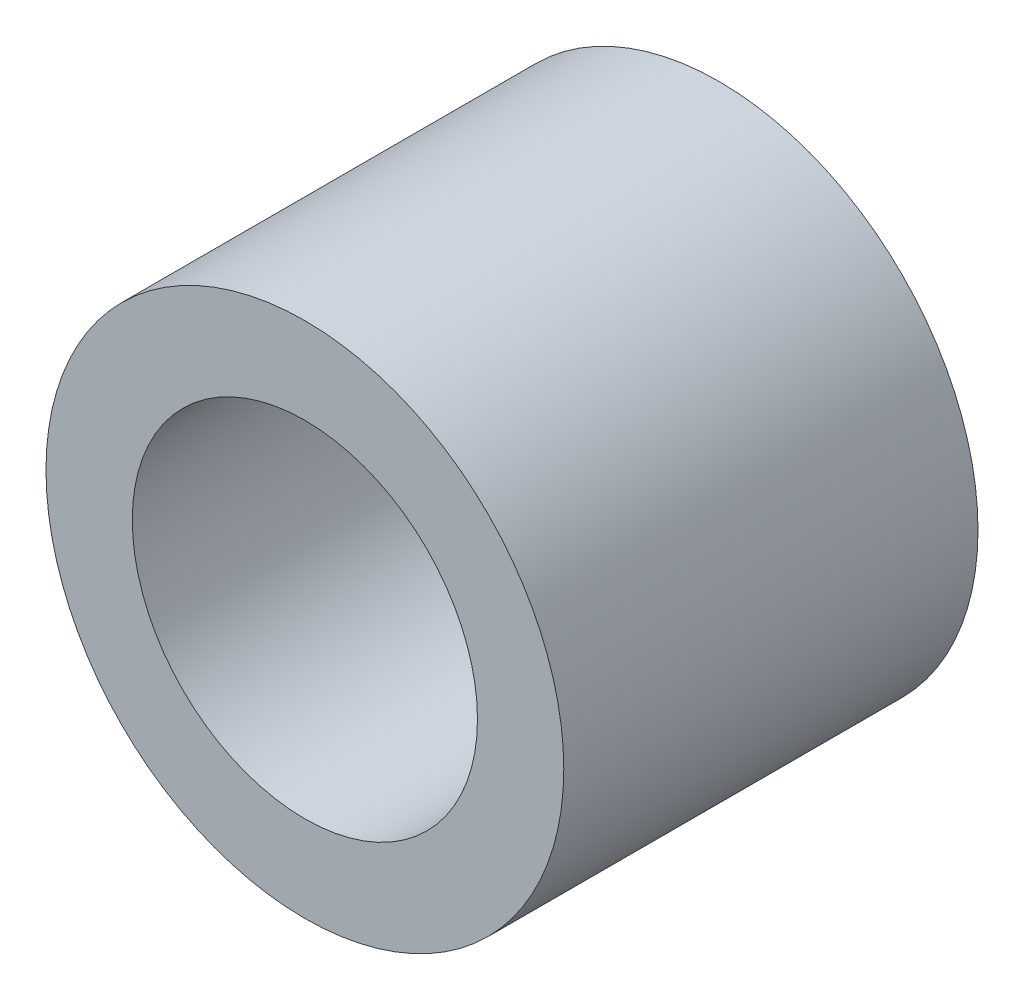
ISO-10303-21;
HEADER;
FILE_DESCRIPTION(('STEP AP214'),'2;1');
FILE_NAME('part.step','',(''),(''),'','','');
FILE_SCHEMA(('AUTOMOTIVE_DESIGN { 1 0 10303 214 1 1 1 1 }'));
ENDSEC;
DATA;
#1=APPLICATION_CONTEXT('core data for automotive mechanical design processes');
#2=APPLICATION_PROTOCOL_DEFINITION('international standard','automotive_design',2000,#1);
#3=PRODUCT_CONTEXT('',#1,'mechanical');
#4=PRODUCT('Part','Part','',(#3));
#5=PRODUCT_RELATED_PRODUCT_CATEGORY('part','',(#4));
#6=PRODUCT_DEFINITION_FORMATION('','',#4);
#7=PRODUCT_DEFINITION_CONTEXT('part definition',#1,'design');
#8=PRODUCT_DEFINITION('design','',#6,#7);
#9=PRODUCT_DEFINITION_SHAPE('','',#8);
#10=(LENGTH_UNIT() NAMED_UNIT(*) SI_UNIT(.MILLI.,.METRE.));
#11=(NAMED_UNIT(*) PLANE_ANGLE_UNIT() SI_UNIT($,.RADIAN.));
#12=(NAMED_UNIT(*) SI_UNIT($,.STERADIAN.) SOLID_ANGLE_UNIT());
#13=UNCERTAINTY_MEASURE_WITH_UNIT(LENGTH_MEASURE(1.E-05),#10,'distance_accuracy_value','');
#14=(GEOMETRIC_REPRESENTATION_CONTEXT(3) GLOBAL_UNCERTAINTY_ASSIGNED_CONTEXT((#13)) GLOBAL_UNIT_ASSIGNED_CONTEXT((#10,
#11,#12)) REPRESENTATION_CONTEXT('',''));
#15=CARTESIAN_POINT('',(0.,0.,0.));
#16=DIRECTION('',(0.,0.,1.));
#17=DIRECTION('',(1.,0.,0.));
#18=AXIS2_PLACEMENT_3D('',#15,#16,#17);
#19=CARTESIAN_POINT('',(0.,0.,15.24));
#20=DIRECTION('',(0.,0.,1.));
#21=DIRECTION('',(1.,0.,0.));
#22=AXIS2_PLACEMENT_3D('',#19,#20,#21);
#23=PLANE('',#22);
#24=CARTESIAN_POINT('',(0.,0.,15.24));
#25=DIRECTION('',(0.,0.,1.));
#26=DIRECTION('',(1.,0.,0.));
#27=AXIS2_PLACEMENT_3D('',#24,#25,#26);
#28=CIRCLE('',#27,9.525);
#29=CARTESIAN_POINT('',(9.525,0.,15.24));
#30=VERTEX_POINT('',#29);
#31=EDGE_CURVE('E10',#30,#30,#28,.T.);
#32=ORIENTED_EDGE('',*,*,#31,.T.);
#33=EDGE_LOOP('',(#32));
#34=FACE_BOUND('',#33,.T.);
#35=CARTESIAN_POINT('',(0.,0.,15.24));
#36=DIRECTION('',(0.,0.,1.));
#37=DIRECTION('',(1.,0.,0.));
#38=AXIS2_PLACEMENT_3D('',#35,#36,#37);
#39=CIRCLE('',#38,6.35);
#40=CARTESIAN_POINT('',(6.35,0.,15.24));
#41=VERTEX_POINT('',#40);
#42=EDGE_CURVE('E50',#41,#41,#39,.T.);
#43=ORIENTED_EDGE('',*,*,#42,.F.);
#44=EDGE_LOOP('',(#43));
#45=FACE_BOUND('',#44,.T.);
#46=ADVANCED_FACE('F37',(#34,#45),#23,.T.);
#47=CARTESIAN_POINT('',(0.,0.,0.));
#48=DIRECTION('',(0.,0.,1.));
#49=DIRECTION('',(1.,0.,0.));
#50=AXIS2_PLACEMENT_3D('',#47,#48,#49);
#51=PLANE('',#50);
#52=CARTESIAN_POINT('',(0.,0.,0.));
#53=DIRECTION('',(0.,0.,1.));
#54=DIRECTION('',(1.,0.,0.));
#55=AXIS2_PLACEMENT_3D('',#52,#53,#54);
#56=CIRCLE('',#55,9.525);
#57=CARTESIAN_POINT('',(9.525,0.,0.));
#58=VERTEX_POINT('',#57);
#59=EDGE_CURVE('E41',#58,#58,#56,.T.);
#60=ORIENTED_EDGE('',*,*,#59,.F.);
#61=EDGE_LOOP('',(#60));
#62=FACE_BOUND('',#61,.T.);
#63=CARTESIAN_POINT('',(0.,0.,0.));
#64=DIRECTION('',(0.,0.,1.));
#65=DIRECTION('',(1.,0.,0.));
#66=AXIS2_PLACEMENT_3D('',#63,#64,#65);
#67=CIRCLE('',#66,6.35);
#68=CARTESIAN_POINT('',(6.35,0.,0.));
#69=VERTEX_POINT('',#68);
#70=EDGE_CURVE('E52',#69,#69,#67,.T.);
#71=ORIENTED_EDGE('',*,*,#70,.T.);
#72=EDGE_LOOP('',(#71));
#73=FACE_BOUND('',#72,.T.);
#74=ADVANCED_FACE('F64',(#62,#73),#51,.F.);
#75=CARTESIAN_POINT('',(0.,0.,15.24));
#76=DIRECTION('',(0.,0.,-1.));
#77=DIRECTION('',(-1.,0.,0.));
#78=AXIS2_PLACEMENT_3D('',#75,#76,#77);
#79=CYLINDRICAL_SURFACE('',#78,9.525);
#80=ORIENTED_EDGE('',*,*,#31,.F.);
#81=EDGE_LOOP('',(#80));
#82=FACE_BOUND('',#81,.T.);
#83=ORIENTED_EDGE('',*,*,#59,.T.);
#84=EDGE_LOOP('',(#83));
#85=FACE_BOUND('',#84,.T.);
#86=ADVANCED_FACE('F39',(#82,#85),#79,.T.);
#87=CARTESIAN_POINT('',(0.,0.,15.24));
#88=DIRECTION('',(0.,0.,-1.));
#89=DIRECTION('',(-1.,0.,0.));
#90=AXIS2_PLACEMENT_3D('',#87,#88,#89);
#91=CYLINDRICAL_SURFACE('',#90,6.35);
#92=ORIENTED_EDGE('',*,*,#42,.T.);
#93=EDGE_LOOP('',(#92));
#94=FACE_BOUND('',#93,.T.);
#95=ORIENTED_EDGE('',*,*,#70,.F.);
#96=EDGE_LOOP('',(#95));
#97=FACE_BOUND('',#96,.T.);
#98=ADVANCED_FACE('F60',(#94,#97),#91,.F.);
#99=CLOSED_SHELL('',(#46,#74,#86,#98));
#100=MANIFOLD_SOLID_BREP('B2',#99);
#101=ADVANCED_BREP_SHAPE_REPRESENTATION('',(#18,#100),#14);
#102=SHAPE_DEFINITION_REPRESENTATION(#9,#101);
ENDSEC;
END-ISO-10303-21;
